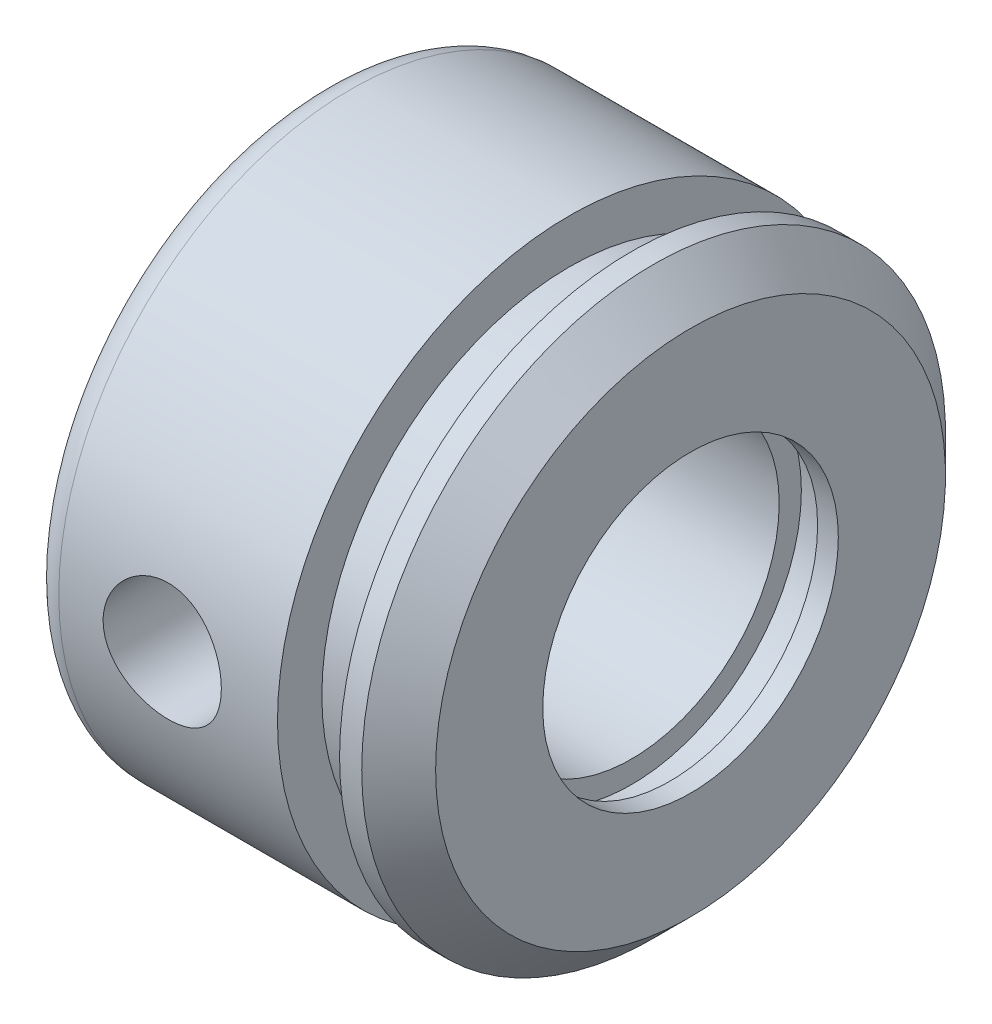
ISO-10303-21;
HEADER;
FILE_DESCRIPTION(('STEP AP214'),'2;1');
FILE_NAME('part.step','',(''),(''),'','','');
FILE_SCHEMA(('AUTOMOTIVE_DESIGN { 1 0 10303 214 1 1 1 1 }'));
ENDSEC;
DATA;
#1=APPLICATION_CONTEXT('core data for automotive mechanical design processes');
#2=APPLICATION_PROTOCOL_DEFINITION('international standard','automotive_design',2000,#1);
#3=PRODUCT_CONTEXT('',#1,'mechanical');
#4=PRODUCT('Part','Part','',(#3));
#5=PRODUCT_RELATED_PRODUCT_CATEGORY('part','',(#4));
#6=PRODUCT_DEFINITION_FORMATION('','',#4);
#7=PRODUCT_DEFINITION_CONTEXT('part definition',#1,'design');
#8=PRODUCT_DEFINITION('design','',#6,#7);
#9=PRODUCT_DEFINITION_SHAPE('','',#8);
#10=(LENGTH_UNIT() NAMED_UNIT(*) SI_UNIT(.MILLI.,.METRE.));
#11=(NAMED_UNIT(*) PLANE_ANGLE_UNIT() SI_UNIT($,.RADIAN.));
#12=(NAMED_UNIT(*) SI_UNIT($,.STERADIAN.) SOLID_ANGLE_UNIT());
#13=UNCERTAINTY_MEASURE_WITH_UNIT(LENGTH_MEASURE(1.E-05),#10,'distance_accuracy_value','');
#14=(GEOMETRIC_REPRESENTATION_CONTEXT(3) GLOBAL_UNCERTAINTY_ASSIGNED_CONTEXT((#13)) GLOBAL_UNIT_ASSIGNED_CONTEXT((#10,
#11,#12)) REPRESENTATION_CONTEXT('',''));
#15=CARTESIAN_POINT('',(0.,0.,0.));
#16=DIRECTION('',(0.,0.,1.));
#17=DIRECTION('',(1.,0.,0.));
#18=AXIS2_PLACEMENT_3D('',#15,#16,#17);
#19=CARTESIAN_POINT('',(-92.,0.,0.));
#20=DIRECTION('',(-1.,0.,0.));
#21=DIRECTION('',(0.,0.,1.));
#22=AXIS2_PLACEMENT_3D('',#19,#20,#21);
#23=CYLINDRICAL_SURFACE('',#22,19.75);
#24=CARTESIAN_POINT('',(-22.,0.,0.));
#25=DIRECTION('',(-1.,0.,0.));
#26=DIRECTION('',(0.,0.,1.));
#27=AXIS2_PLACEMENT_3D('',#24,#25,#26);
#28=CIRCLE('',#27,19.75);
#29=CARTESIAN_POINT('',(-22.,0.,19.75));
#30=VERTEX_POINT('',#29);
#31=EDGE_CURVE('E10',#30,#30,#28,.F.);
#32=ORIENTED_EDGE('',*,*,#31,.T.);
#33=EDGE_LOOP('',(#32));
#34=FACE_BOUND('',#33,.T.);
#35=CARTESIAN_POINT('',(-11.,0.,-19.75));
#36=CARTESIAN_POINT('',(-11.0000081048438,-0.22224806995432,-19.7499958962363));
#37=CARTESIAN_POINT('',(-11.018585405714,-0.444597992091762,-19.7462100877467));
#38=CARTESIAN_POINT('',(-11.092342402588,-0.8830088969307,-19.7314729765692));
#39=CARTESIAN_POINT('',(-11.147550796504,-1.09906481006599,-19.7205160559057));
#40=CARTESIAN_POINT('',(-11.2927912807559,-1.51848598286426,-19.6926597594527));
#41=CARTESIAN_POINT('',(-11.3827896191594,-1.72186332141992,-19.6757661446668));
#42=CARTESIAN_POINT('',(-11.5949540611827,-2.11061840451368,-19.6378712324076));
#43=CARTESIAN_POINT('',(-11.717118391909,-2.29599714031045,-19.6168701613415));
#44=CARTESIAN_POINT('',(-11.9919430317982,-2.6460772527497,-19.5727446180067));
#45=CARTESIAN_POINT('',(-12.1449634523736,-2.81049304028278,-19.5495970012139));
#46=CARTESIAN_POINT('',(-12.476382594132,-3.1115067612523,-19.5039549292504));
#47=CARTESIAN_POINT('',(-12.6547833303368,-3.24810248387175,-19.4814605261113));
#48=CARTESIAN_POINT('',(-13.0339607109168,-3.49082000171905,-19.439445502203));
#49=CARTESIAN_POINT('',(-13.2349309309764,-3.59664499846113,-19.4199546451824));
#50=CARTESIAN_POINT('',(-13.6522600560012,-3.77291537181802,-19.386482707602));
#51=CARTESIAN_POINT('',(-13.8686173971148,-3.84336433798359,-19.3725010680613));
#52=CARTESIAN_POINT('',(-14.3075031395602,-3.94595354018195,-19.3518649919567));
#53=CARTESIAN_POINT('',(-14.5299096749315,-3.97859545063143,-19.3451146929563));
#54=CARTESIAN_POINT('',(-14.9771370229767,-4.00620242058267,-19.3394171376453));
#55=CARTESIAN_POINT('',(-15.2019575798835,-4.00117143297835,-19.3404690626726));
#56=CARTESIAN_POINT('',(-15.6439531457213,-3.95398078024641,-19.3501700409036));
#57=CARTESIAN_POINT('',(-15.8611926363499,-3.91239720638177,-19.3587012111185));
#58=CARTESIAN_POINT('',(-16.2855466486746,-3.79419156186473,-19.3822137192734));
#59=CARTESIAN_POINT('',(-16.4926606751862,-3.71756777946928,-19.3971953723227));
#60=CARTESIAN_POINT('',(-16.8925394641773,-3.53090946742583,-19.4320407440898));
#61=CARTESIAN_POINT('',(-17.085195057076,-3.42064748971734,-19.4519375169913));
#62=CARTESIAN_POINT('',(-17.4494851344402,-3.17000312790072,-19.4943501681082));
#63=CARTESIAN_POINT('',(-17.6211171403312,-3.02961719768965,-19.5168663545304));
#64=CARTESIAN_POINT('',(-17.9418112685913,-2.71963004925279,-19.5624908847158));
#65=CARTESIAN_POINT('',(-18.0903982873366,-2.54953737608477,-19.585602487023));
#66=CARTESIAN_POINT('',(-18.3570075500807,-2.18659585342351,-19.6294334309143));
#67=CARTESIAN_POINT('',(-18.4750293827025,-1.99374669770145,-19.6501527402985));
#68=CARTESIAN_POINT('',(-18.67724976877,-1.59023196380784,-19.6869175229428));
#69=CARTESIAN_POINT('',(-18.7613929787286,-1.37953790851563,-19.7029553369428));
#70=CARTESIAN_POINT('',(-18.8929554895486,-0.946606869842553,-19.7284921446276));
#71=CARTESIAN_POINT('',(-18.9403793545307,-0.72437132470479,-19.7379919509538));
#72=CARTESIAN_POINT('',(-18.9964819581576,-0.278747524608179,-19.7492688738016));
#73=CARTESIAN_POINT('',(-19.005810725046,-0.0554442844005153,-19.7511755402605));
#74=CARTESIAN_POINT('',(-18.9872103970194,0.389530115911798,-19.7474116073557));
#75=CARTESIAN_POINT('',(-18.9592834523788,0.611201369466742,-19.7417414453012));
#76=CARTESIAN_POINT('',(-18.8675043659978,1.04451493822208,-19.7235421195795));
#77=CARTESIAN_POINT('',(-18.8039867217177,1.25623102179643,-19.7110768485899));
#78=CARTESIAN_POINT('',(-18.643195540891,1.66600722123357,-19.6806802036847));
#79=CARTESIAN_POINT('',(-18.5459194277112,1.86406629333409,-19.6627484125468));
#80=CARTESIAN_POINT('',(-18.3189731664371,2.24364076398116,-19.6230855410972));
#81=CARTESIAN_POINT('',(-18.1889128990941,2.42491813774279,-19.6013097275381));
#82=CARTESIAN_POINT('',(-17.9006114834631,2.76330822552575,-19.556477585192));
#83=CARTESIAN_POINT('',(-17.7423672312408,2.92041827441668,-19.5334211155577));
#84=CARTESIAN_POINT('',(-17.3992274444809,3.20853073961514,-19.4881881633942));
#85=CARTESIAN_POINT('',(-17.2139537767602,3.33908638020733,-19.4660310848181));
#86=CARTESIAN_POINT('',(-16.8237248478528,3.56722604575109,-19.4255213233158));
#87=CARTESIAN_POINT('',(-16.6187703847923,3.66481140704029,-19.4071684862093));
#88=CARTESIAN_POINT('',(-16.1960413197888,3.82363546727091,-19.37650286034));
#89=CARTESIAN_POINT('',(-15.9783408476562,3.88506506501422,-19.3641584088752));
#90=CARTESIAN_POINT('',(-15.5354305006131,3.970410497234,-19.3468413674368));
#91=CARTESIAN_POINT('',(-15.3102216373576,3.99433136481509,-19.3418677884083));
#92=CARTESIAN_POINT('',(-14.8631754278964,4.00379034003382,-19.3399115079409));
#93=CARTESIAN_POINT('',(-14.64135336886,3.99003472091527,-19.3427817657639));
#94=CARTESIAN_POINT('',(-14.203255590768,3.92609258628965,-19.3558606985548));
#95=CARTESIAN_POINT('',(-13.9869798246324,3.8759063801309,-19.3660693112094));
#96=CARTESIAN_POINT('',(-13.5665778523039,3.74084622389978,-19.3926081690103));
#97=CARTESIAN_POINT('',(-13.3624220887846,3.65606099786355,-19.4089227475144));
#98=CARTESIAN_POINT('',(-12.9711235641138,3.45429149146972,-19.4458438523061));
#99=CARTESIAN_POINT('',(-12.7839822776071,3.33730442371053,-19.4664507501007));
#100=CARTESIAN_POINT('',(-12.4285126472362,3.07204888065449,-19.5100831370961));
#101=CARTESIAN_POINT('',(-12.2605686016429,2.92327121184783,-19.5331444906023));
#102=CARTESIAN_POINT('',(-11.9517965790597,2.59970653572918,-19.5788321505124));
#103=CARTESIAN_POINT('',(-11.8109748448775,2.4249135567845,-19.6014583556808));
#104=CARTESIAN_POINT('',(-11.5590083718832,2.05201434266876,-19.6440142476618));
#105=CARTESIAN_POINT('',(-11.4481999643862,1.85367707395027,-19.663912231917));
#106=CARTESIAN_POINT('',(-11.2616620974872,1.44084701523437,-19.6984569973284));
#107=CARTESIAN_POINT('',(-11.1859013032398,1.22636885653041,-19.7131084665515));
#108=CARTESIAN_POINT('',(-11.0861307153843,0.842868488706423,-19.7326930123798));
#109=CARTESIAN_POINT('',(-11.0538897988215,0.676016148606986,-19.7391448663407));
#110=CARTESIAN_POINT('',(-11.0108217027504,0.339462283889183,-19.7477998566169));
#111=CARTESIAN_POINT('',(-10.9999938092366,0.169760854462413,-19.7500031345984));
#112=CARTESIAN_POINT('',(-11.,0.,-19.75));
#113=B_SPLINE_CURVE_WITH_KNOTS('',3,(#35,#36,#37,#38,#39,#40,#41,#42,#43,#44,#45,#46,#47,#48,
#49,#50,#51,#52,#53,#54,#55,#56,#57,#58,#59,#60,#61,#62,#63,#64,#65,#66,#67,#68,#69,#70,#71,#72,
#73,#74,#75,#76,#77,#78,#79,#80,#81,#82,#83,#84,#85,#86,#87,#88,#89,#90,#91,#92,#93,#94,#95,#96,
#97,#98,#99,#100,#101,#102,#103,#104,#105,#106,#107,#108,#109,#110,#111,#112),.UNSPECIFIED.,.T.,
.F.,(4,2,2,2,2,2,2,2,2,2,2,2,2,2,2,2,2,2,2,2,2,2,2,2,2,2,2,2,2,2,2,2,2,2,2,2,2,2,4),(0.,
0.666123128202852,1.33276873467623,1.99876920258741,2.66473297022347,3.33897276094297,
4.01326611155423,4.69386258860974,5.37438999263846,6.04577988155233,6.71709932470904,
7.37802433453845,8.0389816345483,8.70451102092719,9.37011879448611,10.0480131409169,
10.7259166106586,11.4049230410955,12.0838450592151,12.7511327510065,13.4183819308623,
14.0794627198652,14.7405939773139,15.4099980521368,16.0794758948312,16.7594248396206,
17.4393462216956,18.1156447130886,18.7918524476783,19.4554713635581,20.1190846444206,
20.7810067757975,21.4429862213909,22.1164917980326,22.790152212289,23.4710756873757,
24.151389190379,24.6602143166334,25.1690224761109),.UNSPECIFIED.);
#114=CARTESIAN_POINT('',(-11.,0.,-19.75));
#115=VERTEX_POINT('',#114);
#116=EDGE_CURVE('E62',#115,#115,#113,.T.);
#117=ORIENTED_EDGE('',*,*,#116,.F.);
#118=EDGE_LOOP('',(#117));
#119=FACE_BOUND('',#118,.T.);
#120=CARTESIAN_POINT('',(-11.,0.,19.75));
#121=CARTESIAN_POINT('',(-11.0000081048438,0.222248069954321,19.7499958962363));
#122=CARTESIAN_POINT('',(-11.018585405714,0.444597992091763,19.7462100877467));
#123=CARTESIAN_POINT('',(-11.092342402588,0.8830088969307,19.7314729765692));
#124=CARTESIAN_POINT('',(-11.147550796504,1.09906481006599,19.7205160559057));
#125=CARTESIAN_POINT('',(-11.2927912807559,1.51848598286426,19.6926597594527));
#126=CARTESIAN_POINT('',(-11.3827896191594,1.72186332141992,19.6757661446668));
#127=CARTESIAN_POINT('',(-11.5949540611827,2.11061840451368,19.6378712324076));
#128=CARTESIAN_POINT('',(-11.717118391909,2.29599714031044,19.6168701613415));
#129=CARTESIAN_POINT('',(-11.9919430317982,2.6460772527497,19.5727446180067));
#130=CARTESIAN_POINT('',(-12.1449634523736,2.81049304028278,19.5495970012139));
#131=CARTESIAN_POINT('',(-12.476382594132,3.1115067612523,19.5039549292504));
#132=CARTESIAN_POINT('',(-12.6547833303368,3.24810248387175,19.4814605261113));
#133=CARTESIAN_POINT('',(-13.0339607109168,3.49082000171905,19.439445502203));
#134=CARTESIAN_POINT('',(-13.2349309309764,3.59664499846114,19.4199546451824));
#135=CARTESIAN_POINT('',(-13.6522600560012,3.77291537181803,19.386482707602));
#136=CARTESIAN_POINT('',(-13.8686173971148,3.84336433798359,19.3725010680613));
#137=CARTESIAN_POINT('',(-14.3075031395602,3.94595354018195,19.3518649919567));
#138=CARTESIAN_POINT('',(-14.5299096749315,3.97859545063143,19.3451146929563));
#139=CARTESIAN_POINT('',(-14.9771370229767,4.00620242058267,19.3394171376453));
#140=CARTESIAN_POINT('',(-15.2019575798835,4.00117143297835,19.3404690626726));
#141=CARTESIAN_POINT('',(-15.6439531457213,3.95398078024641,19.3501700409036));
#142=CARTESIAN_POINT('',(-15.8611926363499,3.91239720638177,19.3587012111185));
#143=CARTESIAN_POINT('',(-16.2855466486746,3.79419156186472,19.3822137192734));
#144=CARTESIAN_POINT('',(-16.4926606751862,3.71756777946928,19.3971953723227));
#145=CARTESIAN_POINT('',(-16.8925394641773,3.53090946742583,19.4320407440898));
#146=CARTESIAN_POINT('',(-17.085195057076,3.42064748971733,19.4519375169913));
#147=CARTESIAN_POINT('',(-17.4494851344402,3.17000312790072,19.4943501681082));
#148=CARTESIAN_POINT('',(-17.6211171403312,3.02961719768965,19.5168663545304));
#149=CARTESIAN_POINT('',(-17.9418112685913,2.71963004925278,19.5624908847158));
#150=CARTESIAN_POINT('',(-18.0903982873366,2.54953737608477,19.585602487023));
#151=CARTESIAN_POINT('',(-18.3570075500807,2.18659585342351,19.6294334309143));
#152=CARTESIAN_POINT('',(-18.4750293827025,1.99374669770145,19.6501527402985));
#153=CARTESIAN_POINT('',(-18.67724976877,1.59023196380784,19.6869175229428));
#154=CARTESIAN_POINT('',(-18.7613929787286,1.37953790851563,19.7029553369428));
#155=CARTESIAN_POINT('',(-18.8929554895486,0.946606869842551,19.7284921446276));
#156=CARTESIAN_POINT('',(-18.9403793545307,0.724371324704788,19.7379919509538));
#157=CARTESIAN_POINT('',(-18.9964819581576,0.278747524608176,19.7492688738016));
#158=CARTESIAN_POINT('',(-19.005810725046,0.0554442844005117,19.7511755402605));
#159=CARTESIAN_POINT('',(-18.9872103970194,-0.389530115911801,19.7474116073557));
#160=CARTESIAN_POINT('',(-18.9592834523788,-0.611201369466745,19.7417414453012));
#161=CARTESIAN_POINT('',(-18.8675043659978,-1.04451493822208,19.7235421195795));
#162=CARTESIAN_POINT('',(-18.8039867217177,-1.25623102179644,19.7110768485899));
#163=CARTESIAN_POINT('',(-18.643195540891,-1.66600722123358,19.6806802036847));
#164=CARTESIAN_POINT('',(-18.5459194277112,-1.8640662933341,19.6627484125468));
#165=CARTESIAN_POINT('',(-18.3189731664371,-2.24364076398116,19.6230855410972));
#166=CARTESIAN_POINT('',(-18.1889128990941,-2.4249181377428,19.6013097275381));
#167=CARTESIAN_POINT('',(-17.9006114834631,-2.76330822552576,19.556477585192));
#168=CARTESIAN_POINT('',(-17.7423672312408,-2.92041827441668,19.5334211155577));
#169=CARTESIAN_POINT('',(-17.3992274444809,-3.20853073961514,19.4881881633942));
#170=CARTESIAN_POINT('',(-17.2139537767602,-3.33908638020733,19.4660310848181));
#171=CARTESIAN_POINT('',(-16.8237248478528,-3.56722604575109,19.4255213233158));
#172=CARTESIAN_POINT('',(-16.6187703847923,-3.66481140704029,19.4071684862093));
#173=CARTESIAN_POINT('',(-16.1960413197888,-3.82363546727091,19.37650286034));
#174=CARTESIAN_POINT('',(-15.9783408476562,-3.88506506501422,19.3641584088752));
#175=CARTESIAN_POINT('',(-15.5354305006131,-3.970410497234,19.3468413674368));
#176=CARTESIAN_POINT('',(-15.3102216373576,-3.99433136481509,19.3418677884083));
#177=CARTESIAN_POINT('',(-14.8631754278964,-4.00379034003382,19.3399115079409));
#178=CARTESIAN_POINT('',(-14.64135336886,-3.99003472091527,19.3427817657639));
#179=CARTESIAN_POINT('',(-14.203255590768,-3.92609258628965,19.3558606985548));
#180=CARTESIAN_POINT('',(-13.9869798246324,-3.8759063801309,19.3660693112094));
#181=CARTESIAN_POINT('',(-13.5665778523039,-3.74084622389978,19.3926081690103));
#182=CARTESIAN_POINT('',(-13.3624220887846,-3.65606099786355,19.4089227475144));
#183=CARTESIAN_POINT('',(-12.9711235641138,-3.45429149146972,19.4458438523061));
#184=CARTESIAN_POINT('',(-12.7839822776071,-3.33730442371053,19.4664507501007));
#185=CARTESIAN_POINT('',(-12.4285126472362,-3.07204888065449,19.5100831370961));
#186=CARTESIAN_POINT('',(-12.2605686016429,-2.92327121184783,19.5331444906023));
#187=CARTESIAN_POINT('',(-11.9517965790597,-2.59970653572918,19.5788321505124));
#188=CARTESIAN_POINT('',(-11.8109748448775,-2.4249135567845,19.6014583556808));
#189=CARTESIAN_POINT('',(-11.5590083718832,-2.05201434266876,19.6440142476618));
#190=CARTESIAN_POINT('',(-11.4481999643862,-1.85367707395027,19.663912231917));
#191=CARTESIAN_POINT('',(-11.2616620974872,-1.44084701523437,19.6984569973284));
#192=CARTESIAN_POINT('',(-11.1859013032398,-1.22636885653041,19.7131084665515));
#193=CARTESIAN_POINT('',(-11.0861307153843,-0.842868488706419,19.7326930123798));
#194=CARTESIAN_POINT('',(-11.0538897988215,-0.676016148606982,19.7391448663407));
#195=CARTESIAN_POINT('',(-11.0108217027504,-0.339462283889181,19.7477998566169));
#196=CARTESIAN_POINT('',(-10.9999938092366,-0.169760854462413,19.7500031345984));
#197=CARTESIAN_POINT('',(-11.,0.,19.75));
#198=B_SPLINE_CURVE_WITH_KNOTS('',3,(#120,#121,#122,#123,#124,#125,#126,#127,#128,#129,#130,
#131,#132,#133,#134,#135,#136,#137,#138,#139,#140,#141,#142,#143,#144,#145,#146,#147,#148,#149,
#150,#151,#152,#153,#154,#155,#156,#157,#158,#159,#160,#161,#162,#163,#164,#165,#166,#167,#168,
#169,#170,#171,#172,#173,#174,#175,#176,#177,#178,#179,#180,#181,#182,#183,#184,#185,#186,#187,
#188,#189,#190,#191,#192,#193,#194,#195,#196,#197),.UNSPECIFIED.,.T.,.F.,(4,2,2,2,2,2,2,2,2,2,2,
2,2,2,2,2,2,2,2,2,2,2,2,2,2,2,2,2,2,2,2,2,2,2,2,2,2,2,4),(0.,0.666123128202852,1.33276873467623,
1.99876920258741,2.66473297022347,3.33897276094297,4.01326611155423,4.69386258860974,
5.37438999263846,6.04577988155233,6.71709932470904,7.37802433453846,8.0389816345483,
8.70451102092719,9.37011879448611,10.0480131409169,10.7259166106586,11.4049230410955,
12.0838450592151,12.7511327510065,13.4183819308623,14.0794627198652,14.7405939773139,
15.4099980521368,16.0794758948312,16.7594248396206,17.4393462216957,18.1156447130887,
18.7918524476783,19.4554713635581,20.1190846444206,20.7810067757975,21.4429862213909,
22.1164917980326,22.790152212289,23.4710756873757,24.151389190379,24.6602143166334,
25.169022476111),.UNSPECIFIED.);
#199=CARTESIAN_POINT('',(-11.,0.,19.75));
#200=VERTEX_POINT('',#199);
#201=EDGE_CURVE('E86',#200,#200,#198,.T.);
#202=ORIENTED_EDGE('',*,*,#201,.F.);
#203=EDGE_LOOP('',(#202));
#204=FACE_BOUND('',#203,.T.);
#205=CARTESIAN_POINT('',(-7.2,0.,0.));
#206=DIRECTION('',(-1.,0.,0.));
#207=DIRECTION('',(0.,0.,1.));
#208=AXIS2_PLACEMENT_3D('',#205,#206,#207);
#209=CIRCLE('',#208,19.75);
#210=CARTESIAN_POINT('',(-7.2,0.,19.75));
#211=VERTEX_POINT('',#210);
#212=EDGE_CURVE('E45',#211,#211,#209,.T.);
#213=ORIENTED_EDGE('',*,*,#212,.T.);
#214=EDGE_LOOP('',(#213));
#215=FACE_BOUND('',#214,.T.);
#216=ADVANCED_FACE('F33',(#34,#119,#204,#215),#23,.T.);
#217=CARTESIAN_POINT('',(-7.2,19.75,0.));
#218=DIRECTION('',(1.,0.,0.));
#219=DIRECTION('',(0.,0.,-1.));
#220=AXIS2_PLACEMENT_3D('',#217,#218,#219);
#221=PLANE('',#220);
#222=CARTESIAN_POINT('',(-7.2,0.,0.));
#223=DIRECTION('',(-1.,0.,0.));
#224=DIRECTION('',(0.,0.,1.));
#225=AXIS2_PLACEMENT_3D('',#222,#223,#224);
#226=CIRCLE('',#225,16.75);
#227=CARTESIAN_POINT('',(-7.2,0.,16.75));
#228=VERTEX_POINT('',#227);
#229=EDGE_CURVE('E52',#228,#228,#226,.T.);
#230=ORIENTED_EDGE('',*,*,#229,.T.);
#231=EDGE_LOOP('',(#230));
#232=FACE_BOUND('',#231,.T.);
#233=ORIENTED_EDGE('',*,*,#212,.F.);
#234=EDGE_LOOP('',(#233));
#235=FACE_BOUND('',#234,.T.);
#236=ADVANCED_FACE('F124',(#232,#235),#221,.T.);
#237=CARTESIAN_POINT('',(-92.,0.,0.));
#238=DIRECTION('',(-1.,0.,0.));
#239=DIRECTION('',(0.,0.,1.));
#240=AXIS2_PLACEMENT_3D('',#237,#238,#239);
#241=CYLINDRICAL_SURFACE('',#240,16.75);
#242=CARTESIAN_POINT('',(-3.,0.,0.));
#243=DIRECTION('',(-1.,0.,0.));
#244=DIRECTION('',(0.,0.,1.));
#245=AXIS2_PLACEMENT_3D('',#242,#243,#244);
#246=CIRCLE('',#245,16.75);
#247=CARTESIAN_POINT('',(-3.,0.,16.75));
#248=VERTEX_POINT('',#247);
#249=EDGE_CURVE('E118',#248,#248,#246,.T.);
#250=ORIENTED_EDGE('',*,*,#249,.T.);
#251=EDGE_LOOP('',(#250));
#252=FACE_BOUND('',#251,.T.);
#253=ORIENTED_EDGE('',*,*,#229,.F.);
#254=EDGE_LOOP('',(#253));
#255=FACE_BOUND('',#254,.T.);
#256=ADVANCED_FACE('F127',(#252,#255),#241,.T.);
#257=CARTESIAN_POINT('',(-3.,16.75,0.));
#258=DIRECTION('',(-1.,0.,0.));
#259=DIRECTION('',(0.,0.,1.));
#260=AXIS2_PLACEMENT_3D('',#257,#258,#259);
#261=PLANE('',#260);
#262=CARTESIAN_POINT('',(-3.,0.,0.));
#263=DIRECTION('',(-1.,0.,0.));
#264=DIRECTION('',(0.,0.,1.));
#265=AXIS2_PLACEMENT_3D('',#262,#263,#264);
#266=CIRCLE('',#265,19.75);
#267=CARTESIAN_POINT('',(-3.,0.,19.75));
#268=VERTEX_POINT('',#267);
#269=EDGE_CURVE('E115',#268,#268,#266,.T.);
#270=ORIENTED_EDGE('',*,*,#269,.T.);
#271=EDGE_LOOP('',(#270));
#272=FACE_BOUND('',#271,.T.);
#273=ORIENTED_EDGE('',*,*,#249,.F.);
#274=EDGE_LOOP('',(#273));
#275=FACE_BOUND('',#274,.T.);
#276=ADVANCED_FACE('F129',(#272,#275),#261,.T.);
#277=CARTESIAN_POINT('',(-92.,0.,0.));
#278=DIRECTION('',(-1.,0.,0.));
#279=DIRECTION('',(0.,0.,1.));
#280=AXIS2_PLACEMENT_3D('',#277,#278,#279);
#281=CYLINDRICAL_SURFACE('',#280,19.75);
#282=CARTESIAN_POINT('',(-1.5,0.,0.));
#283=DIRECTION('',(-1.,0.,0.));
#284=DIRECTION('',(0.,0.,1.));
#285=AXIS2_PLACEMENT_3D('',#282,#283,#284);
#286=CIRCLE('',#285,19.75);
#287=CARTESIAN_POINT('',(-1.5,0.,19.75));
#288=VERTEX_POINT('',#287);
#289=EDGE_CURVE('E112',#288,#288,#286,.T.);
#290=ORIENTED_EDGE('',*,*,#289,.T.);
#291=EDGE_LOOP('',(#290));
#292=FACE_BOUND('',#291,.T.);
#293=ORIENTED_EDGE('',*,*,#269,.F.);
#294=EDGE_LOOP('',(#293));
#295=FACE_BOUND('',#294,.T.);
#296=ADVANCED_FACE('F136',(#292,#295),#281,.T.);
#297=CARTESIAN_POINT('',(-1.5,0.,0.));
#298=DIRECTION('',(-1.,0.,0.));
#299=DIRECTION('',(0.,0.,1.));
#300=AXIS2_PLACEMENT_3D('',#297,#298,#299);
#301=CONICAL_SURFACE('',#300,19.75,0.785398163397442);
#302=CARTESIAN_POINT('',(1.,0.,0.));
#303=DIRECTION('',(-1.,0.,0.));
#304=DIRECTION('',(0.,0.,1.));
#305=AXIS2_PLACEMENT_3D('',#302,#303,#304);
#306=CIRCLE('',#305,17.25);
#307=CARTESIAN_POINT('',(1.,0.,17.25));
#308=VERTEX_POINT('',#307);
#309=EDGE_CURVE('E109',#308,#308,#306,.T.);
#310=ORIENTED_EDGE('',*,*,#309,.T.);
#311=EDGE_LOOP('',(#310));
#312=FACE_BOUND('',#311,.T.);
#313=ORIENTED_EDGE('',*,*,#289,.F.);
#314=EDGE_LOOP('',(#313));
#315=FACE_BOUND('',#314,.T.);
#316=ADVANCED_FACE('F188',(#312,#315),#301,.T.);
#317=CARTESIAN_POINT('',(0.999999999999997,17.25,0.));
#318=DIRECTION('',(1.,0.,0.));
#319=DIRECTION('',(0.,0.,-1.));
#320=AXIS2_PLACEMENT_3D('',#317,#318,#319);
#321=PLANE('',#320);
#322=CARTESIAN_POINT('',(1.,0.,0.));
#323=DIRECTION('',(-1.,0.,0.));
#324=DIRECTION('',(0.,0.,1.));
#325=AXIS2_PLACEMENT_3D('',#322,#323,#324);
#326=CIRCLE('',#325,10.);
#327=CARTESIAN_POINT('',(1.,0.,10.));
#328=VERTEX_POINT('',#327);
#329=EDGE_CURVE('E106',#328,#328,#326,.T.);
#330=ORIENTED_EDGE('',*,*,#329,.T.);
#331=EDGE_LOOP('',(#330));
#332=FACE_BOUND('',#331,.T.);
#333=ORIENTED_EDGE('',*,*,#309,.F.);
#334=EDGE_LOOP('',(#333));
#335=FACE_BOUND('',#334,.T.);
#336=ADVANCED_FACE('F182',(#332,#335),#321,.T.);
#337=CARTESIAN_POINT('',(-92.,0.,0.));
#338=DIRECTION('',(-1.,0.,0.));
#339=DIRECTION('',(0.,0.,1.));
#340=AXIS2_PLACEMENT_3D('',#337,#338,#339);
#341=CYLINDRICAL_SURFACE('',#340,10.);
#342=CARTESIAN_POINT('',(-0.400000000000011,0.,0.));
#343=DIRECTION('',(-1.,0.,0.));
#344=DIRECTION('',(0.,0.,1.));
#345=AXIS2_PLACEMENT_3D('',#342,#343,#344);
#346=CIRCLE('',#345,10.);
#347=CARTESIAN_POINT('',(-0.400000000000011,0.,10.));
#348=VERTEX_POINT('',#347);
#349=EDGE_CURVE('E103',#348,#348,#346,.T.);
#350=ORIENTED_EDGE('',*,*,#349,.T.);
#351=EDGE_LOOP('',(#350));
#352=FACE_BOUND('',#351,.T.);
#353=ORIENTED_EDGE('',*,*,#329,.F.);
#354=EDGE_LOOP('',(#353));
#355=FACE_BOUND('',#354,.T.);
#356=ADVANCED_FACE('F176',(#352,#355),#341,.F.);
#357=CARTESIAN_POINT('',(-0.400000000000005,10.,0.));
#358=DIRECTION('',(-1.,0.,0.));
#359=DIRECTION('',(0.,0.,1.));
#360=AXIS2_PLACEMENT_3D('',#357,#358,#359);
#361=PLANE('',#360);
#362=CARTESIAN_POINT('',(-0.400000000000011,0.,0.));
#363=DIRECTION('',(-1.,0.,0.));
#364=DIRECTION('',(0.,0.,1.));
#365=AXIS2_PLACEMENT_3D('',#362,#363,#364);
#366=CIRCLE('',#365,11.5);
#367=CARTESIAN_POINT('',(-0.400000000000011,0.,11.5));
#368=VERTEX_POINT('',#367);
#369=EDGE_CURVE('E100',#368,#368,#366,.T.);
#370=ORIENTED_EDGE('',*,*,#369,.T.);
#371=EDGE_LOOP('',(#370));
#372=FACE_BOUND('',#371,.T.);
#373=ORIENTED_EDGE('',*,*,#349,.F.);
#374=EDGE_LOOP('',(#373));
#375=FACE_BOUND('',#374,.T.);
#376=ADVANCED_FACE('F170',(#372,#375),#361,.T.);
#377=CARTESIAN_POINT('',(-92.,0.,0.));
#378=DIRECTION('',(-1.,0.,0.));
#379=DIRECTION('',(0.,0.,1.));
#380=AXIS2_PLACEMENT_3D('',#377,#378,#379);
#381=CYLINDRICAL_SURFACE('',#380,11.5);
#382=CARTESIAN_POINT('',(-3.,0.,0.));
#383=DIRECTION('',(-1.,0.,0.));
#384=DIRECTION('',(0.,0.,1.));
#385=AXIS2_PLACEMENT_3D('',#382,#383,#384);
#386=CIRCLE('',#385,11.5);
#387=CARTESIAN_POINT('',(-3.,0.,11.5));
#388=VERTEX_POINT('',#387);
#389=EDGE_CURVE('E97',#388,#388,#386,.T.);
#390=ORIENTED_EDGE('',*,*,#389,.T.);
#391=EDGE_LOOP('',(#390));
#392=FACE_BOUND('',#391,.T.);
#393=ORIENTED_EDGE('',*,*,#369,.F.);
#394=EDGE_LOOP('',(#393));
#395=FACE_BOUND('',#394,.T.);
#396=ADVANCED_FACE('F165',(#392,#395),#381,.F.);
#397=CARTESIAN_POINT('',(-3.,11.5,0.));
#398=DIRECTION('',(1.,0.,0.));
#399=DIRECTION('',(0.,0.,-1.));
#400=AXIS2_PLACEMENT_3D('',#397,#398,#399);
#401=PLANE('',#400);
#402=CARTESIAN_POINT('',(-3.,0.,0.));
#403=DIRECTION('',(-1.,0.,0.));
#404=DIRECTION('',(0.,0.,1.));
#405=AXIS2_PLACEMENT_3D('',#402,#403,#404);
#406=CIRCLE('',#405,10.);
#407=CARTESIAN_POINT('',(-3.,0.,10.));
#408=VERTEX_POINT('',#407);
#409=EDGE_CURVE('E94',#408,#408,#406,.T.);
#410=ORIENTED_EDGE('',*,*,#409,.T.);
#411=EDGE_LOOP('',(#410));
#412=FACE_BOUND('',#411,.T.);
#413=ORIENTED_EDGE('',*,*,#389,.F.);
#414=EDGE_LOOP('',(#413));
#415=FACE_BOUND('',#414,.T.);
#416=ADVANCED_FACE('F155',(#412,#415),#401,.T.);
#417=CARTESIAN_POINT('',(-92.,0.,0.));
#418=DIRECTION('',(-1.,0.,0.));
#419=DIRECTION('',(0.,0.,1.));
#420=AXIS2_PLACEMENT_3D('',#417,#418,#419);
#421=CYLINDRICAL_SURFACE('',#420,10.);
#422=CARTESIAN_POINT('',(-11.,0.,10.));
#423=CARTESIAN_POINT('',(-11.0000015749329,-0.107549581345537,9.99999886871264));
#424=CARTESIAN_POINT('',(-11.0043436710802,-0.215132147940362,9.99825999367799));
#425=CARTESIAN_POINT('',(-11.0216733827839,-0.42953520054955,9.99134740691108));
#426=CARTESIAN_POINT('',(-11.0346664534026,-0.536355162703303,9.98617152790588));
#427=CARTESIAN_POINT('',(-11.0692080345506,-0.748635856497417,9.97250573560117));
#428=CARTESIAN_POINT('',(-11.0907750546198,-0.85409313444087,9.96400865312144));
#429=CARTESIAN_POINT('',(-11.1422417304368,-1.0626676111401,9.94393017211574));
#430=CARTESIAN_POINT('',(-11.1721447662553,-1.16578384227259,9.932347522545));
#431=CARTESIAN_POINT('',(-11.273722808716,-1.46979509681069,9.89349112162205));
#432=CARTESIAN_POINT('',(-11.3574218190064,-1.66629107461992,9.86204458846134));
#433=CARTESIAN_POINT('',(-11.5540462173498,-2.04217417878101,9.79113035538708));
#434=CARTESIAN_POINT('',(-11.6669614601149,-2.22156721456798,9.75166544086262));
#435=CARTESIAN_POINT('',(-11.9244687545217,-2.56699339938209,9.66661825353092));
#436=CARTESIAN_POINT('',(-12.0702127105756,-2.73212223266508,9.62084608086599));
#437=CARTESIAN_POINT('',(-12.386800609152,-3.03635232313263,9.52921139577231));
#438=CARTESIAN_POINT('',(-12.5576567590165,-3.17544084661153,9.48334885017047));
#439=CARTESIAN_POINT('',(-12.9288559685663,-3.42974847409894,9.39445587657958));
#440=CARTESIAN_POINT('',(-13.1301729260637,-3.54362978572887,9.35164233015934));
#441=CARTESIAN_POINT('',(-13.5510728428009,-3.73550961465233,9.2766729328807));
#442=CARTESIAN_POINT('',(-13.7706470677414,-3.81352517485723,9.24451202207146));
#443=CARTESIAN_POINT('',(-14.2114246556858,-3.92779760260541,9.19652715590089));
#444=CARTESIAN_POINT('',(-14.4321024680881,-3.96578791979826,9.18002840771385));
#445=CARTESIAN_POINT('',(-14.8772699996773,-4.00434593508728,9.16328008038143));
#446=CARTESIAN_POINT('',(-15.1017577900111,-4.00493203570086,9.16302251073203));
#447=CARTESIAN_POINT('',(-15.5315133422232,-3.9699787321474,9.17821000534301));
#448=CARTESIAN_POINT('',(-15.7370314287657,-3.93695062778272,9.19256349925666));
#449=CARTESIAN_POINT('',(-16.1393191123503,-3.83989376129508,9.23352375055553));
#450=CARTESIAN_POINT('',(-16.3360871763063,-3.77585958980135,9.26013264599921));
#451=CARTESIAN_POINT('',(-16.7200356722919,-3.6173894649114,9.32318970221162));
#452=CARTESIAN_POINT('',(-16.9069384780825,-3.52235972457939,9.35982758573424));
#453=CARTESIAN_POINT('',(-17.26283163275,-3.30501292151569,9.43876232767927));
#454=CARTESIAN_POINT('',(-17.4318152188131,-3.1826856102159,9.48106130910412));
#455=CARTESIAN_POINT('',(-17.760819457596,-2.90310119889356,9.57053473488081));
#456=CARTESIAN_POINT('',(-17.9191374588899,-2.74387492593717,9.61783329953252));
#457=CARTESIAN_POINT('',(-18.2073689560062,-2.40062885486449,9.70919649915615));
#458=CARTESIAN_POINT('',(-18.3372767948212,-2.21660413066997,9.75326048890393));
#459=CARTESIAN_POINT('',(-18.5672348948311,-1.82415530521055,9.83429362529358));
#460=CARTESIAN_POINT('',(-18.666644562394,-1.61532098269266,9.87110540190899));
#461=CARTESIAN_POINT('',(-18.8283357221563,-1.18204753096606,9.93229656657448));
#462=CARTESIAN_POINT('',(-18.8906360751149,-0.957616393699399,9.95668226924746));
#463=CARTESIAN_POINT('',(-18.9728965908394,-0.513791775215591,9.98912279013839));
#464=CARTESIAN_POINT('',(-18.9951449085071,-0.294886587971141,9.99805891667034));
#465=CARTESIAN_POINT('',(-19.0034262010573,0.143690619615706,10.0013695702126));
#466=CARTESIAN_POINT('',(-18.9894685630952,0.363362426448183,9.99574787164577));
#467=CARTESIAN_POINT('',(-18.9274164948959,0.786865478243655,9.97115134127512));
#468=CARTESIAN_POINT('',(-18.8808840392975,0.990964983549762,9.95278782691064));
#469=CARTESIAN_POINT('',(-18.757128583381,1.38827085612275,9.90518882810983));
#470=CARTESIAN_POINT('',(-18.6799016406648,1.58147582045412,9.87595194712999));
#471=CARTESIAN_POINT('',(-18.4944301206379,1.95815757162884,9.80833189541687));
#472=CARTESIAN_POINT('',(-18.3853090559053,2.14115604549353,9.76969631959847));
#473=CARTESIAN_POINT('',(-18.1401193521971,2.4868871825104,9.68746729490809));
#474=CARTESIAN_POINT('',(-18.0040399141861,2.64961168158684,9.64387186219643));
#475=CARTESIAN_POINT('',(-17.6982599740674,2.96144608598878,9.55290235277181));
#476=CARTESIAN_POINT('',(-17.5269329168592,3.10894786734725,9.50546882853787));
#477=CARTESIAN_POINT('',(-17.1611198341097,3.37350239509234,9.4148334583058));
#478=CARTESIAN_POINT('',(-16.9666299998006,3.4905501236659,9.37163231039242));
#479=CARTESIAN_POINT('',(-16.5570766103267,3.69161500286277,9.2942859982933));
#480=CARTESIAN_POINT('',(-16.3418319997565,3.77530118531766,9.2602326182174));
#481=CARTESIAN_POINT('',(-15.8985326983872,3.90459244315908,9.20647346903737));
#482=CARTESIAN_POINT('',(-15.6704875951582,3.95022562452797,9.18675711197461));
#483=CARTESIAN_POINT('',(-15.225744190156,3.99943122157416,9.16543518780389));
#484=CARTESIAN_POINT('',(-15.009410298105,4.00579411777209,9.16262842667612));
#485=CARTESIAN_POINT('',(-14.5789103072789,3.98360636538274,9.17229671415009));
#486=CARTESIAN_POINT('',(-14.3647439367175,3.9550601501471,9.18476982225497));
#487=CARTESIAN_POINT('',(-13.9533355391097,3.86614256488129,9.2225330048627));
#488=CARTESIAN_POINT('',(-13.7557591537789,3.80707437387706,9.2472967218297));
#489=CARTESIAN_POINT('',(-13.3732430382103,3.66001151041638,9.30647993934966));
#490=CARTESIAN_POINT('',(-13.1883068148887,3.5720088493455,9.34090210615105));
#491=CARTESIAN_POINT('',(-12.8247795892905,3.36374310804133,9.41797252826471));
#492=CARTESIAN_POINT('',(-12.6471581693117,3.24192140926543,9.46097893410836));
#493=CARTESIAN_POINT('',(-12.3140178573752,2.97179350239176,9.54927479921251));
#494=CARTESIAN_POINT('',(-12.15850565271,2.82347931168581,9.59456494363941));
#495=CARTESIAN_POINT('',(-11.8635764074694,2.49297412446699,9.68587647140964));
#496=CARTESIAN_POINT('',(-11.7258566160177,2.30921017071955,9.73175488236393));
#497=CARTESIAN_POINT('',(-11.5439518910625,2.01716584575533,9.7949502762577));
#498=CARTESIAN_POINT('',(-11.487392936147,1.91699501972425,9.81509269692655));
#499=CARTESIAN_POINT('',(-11.3829620045947,1.7118011098248,9.85294835133019));
#500=CARTESIAN_POINT('',(-11.335086050192,1.60678027559742,9.87066269647665));
#501=CARTESIAN_POINT('',(-11.249252015315,1.39454646904328,9.9028559935491));
#502=CARTESIAN_POINT('',(-11.2111298452528,1.28740777135871,9.91738778532477));
#503=CARTESIAN_POINT('',(-11.1440786522788,1.06995577523383,9.94319722915714));
#504=CARTESIAN_POINT('',(-11.1151453426501,0.959643983352613,9.95447639837582));
#505=CARTESIAN_POINT('',(-11.066825163851,0.736945215856832,9.97343330649399));
#506=CARTESIAN_POINT('',(-11.047414088355,0.624564263591278,9.98112017494336));
#507=CARTESIAN_POINT('',(-11.0182614293338,0.398419132407602,9.99270031578293));
#508=CARTESIAN_POINT('',(-11.0085129731657,0.284655994966352,9.99659628445551));
#509=CARTESIAN_POINT('',(-11.0012141044266,0.113830463425492,9.99951445883957));
#510=CARTESIAN_POINT('',(-10.999999166478,0.0569198512645297,10.0000005987258));
#511=CARTESIAN_POINT('',(-11.,0.,10.));
#512=B_SPLINE_CURVE_WITH_KNOTS('',3,(#422,#423,#424,#425,#426,#427,#428,#429,#430,#431,#432,
#433,#434,#435,#436,#437,#438,#439,#440,#441,#442,#443,#444,#445,#446,#447,#448,#449,#450,#451,
#452,#453,#454,#455,#456,#457,#458,#459,#460,#461,#462,#463,#464,#465,#466,#467,#468,#469,#470,
#471,#472,#473,#474,#475,#476,#477,#478,#479,#480,#481,#482,#483,#484,#485,#486,#487,#488,#489,
#490,#491,#492,#493,#494,#495,#496,#497,#498,#499,#500,#501,#502,#503,#504,#505,#506,#507,#508,
#509,#510,#511),.UNSPECIFIED.,.T.,.F.,(4,2,2,2,2,2,2,2,2,2,2,2,2,2,2,2,2,2,2,2,2,2,2,2,2,2,2,2,
2,2,2,2,2,2,2,2,2,2,2,2,2,2,2,2,4),(0.,0.322603993422156,0.645411604786483,0.968919914471236,
1.29255959093094,1.93701523385824,2.58124739027476,3.25313995292302,3.9253602176033,
4.62749749529941,5.32930078128043,5.99927442509164,6.66891844572483,7.29195888698822,
7.9151080641227,8.55097484497806,9.18708075776541,9.87235930273289,10.5577741757964,
11.2567305822579,11.9553314412776,12.6125760095619,13.2696501904034,13.8972014302891,
14.5248332988777,15.171662586967,15.8187515089811,16.50856181149,17.1984856998767,
17.8950932218183,18.5911857719204,19.2371857868567,19.8831037702627,20.5034786899771,
21.124025035105,21.7801016801356,22.4363763459696,23.1352007896785,23.4851924266232,
23.8350233218042,24.1785111324565,24.52183846562,24.8642884495951,25.2064946871486,
25.3772305569976),.UNSPECIFIED.);
#513=CARTESIAN_POINT('',(-11.,0.,10.));
#514=VERTEX_POINT('',#513);
#515=EDGE_CURVE('E55',#514,#514,#512,.T.);
#516=ORIENTED_EDGE('',*,*,#515,.F.);
#517=EDGE_LOOP('',(#516));
#518=FACE_BOUND('',#517,.T.);
#519=CARTESIAN_POINT('',(-11.,0.,-10.));
#520=CARTESIAN_POINT('',(-11.0000015749329,0.107549581345536,-9.99999886871264));
#521=CARTESIAN_POINT('',(-11.0043436710802,0.215132147940361,-9.99825999367799));
#522=CARTESIAN_POINT('',(-11.0216733827839,0.429535200549548,-9.99134740691108));
#523=CARTESIAN_POINT('',(-11.0346664534026,0.5363551627033,-9.98617152790588));
#524=CARTESIAN_POINT('',(-11.0692080345506,0.748635856497416,-9.97250573560117));
#525=CARTESIAN_POINT('',(-11.0907750546198,0.854093134440869,-9.96400865312144));
#526=CARTESIAN_POINT('',(-11.1422417304368,1.0626676111401,-9.94393017211574));
#527=CARTESIAN_POINT('',(-11.1721447662553,1.16578384227259,-9.932347522545));
#528=CARTESIAN_POINT('',(-11.273722808716,1.46979509681069,-9.89349112162205));
#529=CARTESIAN_POINT('',(-11.3574218190064,1.66629107461992,-9.86204458846134));
#530=CARTESIAN_POINT('',(-11.5540462173498,2.04217417878102,-9.79113035538708));
#531=CARTESIAN_POINT('',(-11.6669614601149,2.22156721456798,-9.75166544086262));
#532=CARTESIAN_POINT('',(-11.9244687545217,2.56699339938209,-9.66661825353092));
#533=CARTESIAN_POINT('',(-12.0702127105756,2.73212223266508,-9.62084608086599));
#534=CARTESIAN_POINT('',(-12.386800609152,3.03635232313263,-9.52921139577231));
#535=CARTESIAN_POINT('',(-12.5576567590165,3.17544084661153,-9.48334885017047));
#536=CARTESIAN_POINT('',(-12.9288559685663,3.42974847409894,-9.39445587657958));
#537=CARTESIAN_POINT('',(-13.1301729260637,3.54362978572887,-9.35164233015934));
#538=CARTESIAN_POINT('',(-13.5510728428009,3.73550961465233,-9.2766729328807));
#539=CARTESIAN_POINT('',(-13.7706470677414,3.81352517485723,-9.24451202207146));
#540=CARTESIAN_POINT('',(-14.2114246556858,3.92779760260541,-9.19652715590089));
#541=CARTESIAN_POINT('',(-14.4321024680881,3.96578791979826,-9.18002840771385));
#542=CARTESIAN_POINT('',(-14.8772699996773,4.00434593508728,-9.16328008038142));
#543=CARTESIAN_POINT('',(-15.1017577900111,4.00493203570086,-9.16302251073202));
#544=CARTESIAN_POINT('',(-15.5315133422232,3.9699787321474,-9.17821000534301));
#545=CARTESIAN_POINT('',(-15.7370314287657,3.93695062778272,-9.19256349925666));
#546=CARTESIAN_POINT('',(-16.1393191123503,3.83989376129508,-9.23352375055553));
#547=CARTESIAN_POINT('',(-16.3360871763063,3.77585958980135,-9.26013264599921));
#548=CARTESIAN_POINT('',(-16.7200356722919,3.6173894649114,-9.32318970221162));
#549=CARTESIAN_POINT('',(-16.9069384780825,3.52235972457939,-9.35982758573424));
#550=CARTESIAN_POINT('',(-17.2628316327501,3.30501292151569,-9.43876232767927));
#551=CARTESIAN_POINT('',(-17.4318152188131,3.18268561021589,-9.48106130910411));
#552=CARTESIAN_POINT('',(-17.760819457596,2.90310119889356,-9.57053473488081));
#553=CARTESIAN_POINT('',(-17.9191374588899,2.74387492593716,-9.61783329953252));
#554=CARTESIAN_POINT('',(-18.2073689560062,2.40062885486449,-9.70919649915615));
#555=CARTESIAN_POINT('',(-18.3372767948212,2.21660413066997,-9.75326048890393));
#556=CARTESIAN_POINT('',(-18.5672348948311,1.82415530521055,-9.83429362529358));
#557=CARTESIAN_POINT('',(-18.666644562394,1.61532098269266,-9.87110540190899));
#558=CARTESIAN_POINT('',(-18.8283357221563,1.18204753096606,-9.93229656657448));
#559=CARTESIAN_POINT('',(-18.8906360751149,0.9576163936994,-9.95668226924746));
#560=CARTESIAN_POINT('',(-18.9728965908394,0.513791775215591,-9.98912279013839));
#561=CARTESIAN_POINT('',(-18.9951449085071,0.294886587971142,-9.99805891667034));
#562=CARTESIAN_POINT('',(-19.0034262010573,-0.143690619615705,-10.0013695702126));
#563=CARTESIAN_POINT('',(-18.9894685630952,-0.363362426448182,-9.99574787164577));
#564=CARTESIAN_POINT('',(-18.9274164948959,-0.786865478243654,-9.97115134127512));
#565=CARTESIAN_POINT('',(-18.8808840392975,-0.990964983549761,-9.95278782691064));
#566=CARTESIAN_POINT('',(-18.757128583381,-1.38827085612275,-9.90518882810983));
#567=CARTESIAN_POINT('',(-18.6799016406648,-1.58147582045412,-9.87595194712999));
#568=CARTESIAN_POINT('',(-18.4944301206379,-1.95815757162884,-9.80833189541687));
#569=CARTESIAN_POINT('',(-18.3853090559053,-2.14115604549353,-9.76969631959847));
#570=CARTESIAN_POINT('',(-18.1401193521971,-2.4868871825104,-9.68746729490809));
#571=CARTESIAN_POINT('',(-18.0040399141861,-2.64961168158684,-9.64387186219643));
#572=CARTESIAN_POINT('',(-17.6982599740674,-2.96144608598878,-9.55290235277181));
#573=CARTESIAN_POINT('',(-17.5269329168592,-3.10894786734725,-9.50546882853787));
#574=CARTESIAN_POINT('',(-17.1611198341097,-3.37350239509234,-9.4148334583058));
#575=CARTESIAN_POINT('',(-16.9666299998006,-3.4905501236659,-9.37163231039242));
#576=CARTESIAN_POINT('',(-16.5570766103267,-3.69161500286277,-9.2942859982933));
#577=CARTESIAN_POINT('',(-16.3418319997565,-3.77530118531766,-9.26023261821741));
#578=CARTESIAN_POINT('',(-15.8985326983872,-3.90459244315908,-9.20647346903737));
#579=CARTESIAN_POINT('',(-15.6704875951582,-3.95022562452798,-9.18675711197461));
#580=CARTESIAN_POINT('',(-15.225744190156,-3.99943122157416,-9.16543518780389));
#581=CARTESIAN_POINT('',(-15.009410298105,-4.00579411777209,-9.16262842667612));
#582=CARTESIAN_POINT('',(-14.5789103072789,-3.98360636538274,-9.17229671415009));
#583=CARTESIAN_POINT('',(-14.3647439367175,-3.9550601501471,-9.18476982225497));
#584=CARTESIAN_POINT('',(-13.9533355391097,-3.86614256488129,-9.2225330048627));
#585=CARTESIAN_POINT('',(-13.7557591537789,-3.80707437387706,-9.2472967218297));
#586=CARTESIAN_POINT('',(-13.3732430382103,-3.66001151041638,-9.30647993934966));
#587=CARTESIAN_POINT('',(-13.1883068148887,-3.5720088493455,-9.34090210615105));
#588=CARTESIAN_POINT('',(-12.8247795892905,-3.36374310804133,-9.41797252826471));
#589=CARTESIAN_POINT('',(-12.6471581693117,-3.24192140926543,-9.46097893410836));
#590=CARTESIAN_POINT('',(-12.3140178573752,-2.97179350239176,-9.54927479921251));
#591=CARTESIAN_POINT('',(-12.15850565271,-2.82347931168581,-9.59456494363941));
#592=CARTESIAN_POINT('',(-11.8635764074694,-2.49297412446699,-9.68587647140964));
#593=CARTESIAN_POINT('',(-11.7258566160177,-2.30921017071955,-9.73175488236393));
#594=CARTESIAN_POINT('',(-11.5439518910625,-2.01716584575533,-9.7949502762577));
#595=CARTESIAN_POINT('',(-11.487392936147,-1.91699501972425,-9.81509269692655));
#596=CARTESIAN_POINT('',(-11.3829620045947,-1.7118011098248,-9.85294835133019));
#597=CARTESIAN_POINT('',(-11.335086050192,-1.60678027559742,-9.87066269647665));
#598=CARTESIAN_POINT('',(-11.249252015315,-1.39454646904328,-9.9028559935491));
#599=CARTESIAN_POINT('',(-11.2111298452528,-1.28740777135871,-9.91738778532477));
#600=CARTESIAN_POINT('',(-11.1440786522788,-1.06995577523383,-9.94319722915714));
#601=CARTESIAN_POINT('',(-11.1151453426501,-0.959643983352615,-9.95447639837582));
#602=CARTESIAN_POINT('',(-11.066825163851,-0.736945215856833,-9.97343330649399));
#603=CARTESIAN_POINT('',(-11.047414088355,-0.624564263591278,-9.98112017494336));
#604=CARTESIAN_POINT('',(-11.0182614293338,-0.398419132407601,-9.99270031578293));
#605=CARTESIAN_POINT('',(-11.0085129731657,-0.284655994966352,-9.99659628445551));
#606=CARTESIAN_POINT('',(-11.0012141044266,-0.113830463425492,-9.99951445883957));
#607=CARTESIAN_POINT('',(-10.999999166478,-0.0569198512645297,-10.0000005987258));
#608=CARTESIAN_POINT('',(-11.,0.,-10.));
#609=B_SPLINE_CURVE_WITH_KNOTS('',3,(#519,#520,#521,#522,#523,#524,#525,#526,#527,#528,#529,
#530,#531,#532,#533,#534,#535,#536,#537,#538,#539,#540,#541,#542,#543,#544,#545,#546,#547,#548,
#549,#550,#551,#552,#553,#554,#555,#556,#557,#558,#559,#560,#561,#562,#563,#564,#565,#566,#567,
#568,#569,#570,#571,#572,#573,#574,#575,#576,#577,#578,#579,#580,#581,#582,#583,#584,#585,#586,
#587,#588,#589,#590,#591,#592,#593,#594,#595,#596,#597,#598,#599,#600,#601,#602,#603,#604,#605,
#606,#607,#608),.UNSPECIFIED.,.T.,.F.,(4,2,2,2,2,2,2,2,2,2,2,2,2,2,2,2,2,2,2,2,2,2,2,2,2,2,2,2,
2,2,2,2,2,2,2,2,2,2,2,2,2,2,2,2,4),(0.,0.322603993422155,0.645411604786482,0.968919914471235,
1.29255959093094,1.93701523385824,2.58124739027476,3.25313995292302,3.9253602176033,
4.62749749529941,5.32930078128043,5.99927442509165,6.66891844572483,7.29195888698823,
7.9151080641227,8.55097484497807,9.18708075776541,9.87235930273289,10.5577741757964,
11.2567305822579,11.9553314412776,12.6125760095619,13.2696501904034,13.8972014302891,
14.5248332988777,15.171662586967,15.8187515089811,16.50856181149,17.1984856998767,
17.8950932218183,18.5911857719204,19.2371857868567,19.8831037702627,20.5034786899771,
21.124025035105,21.7801016801356,22.4363763459696,23.1352007896785,23.4851924266232,
23.8350233218042,24.1785111324565,24.52183846562,24.8642884495951,25.2064946871486,
25.3772305569976),.UNSPECIFIED.);
#610=CARTESIAN_POINT('',(-11.,0.,-10.));
#611=VERTEX_POINT('',#610);
#612=EDGE_CURVE('E63',#611,#611,#609,.T.);
#613=ORIENTED_EDGE('',*,*,#612,.F.);
#614=EDGE_LOOP('',(#613));
#615=FACE_BOUND('',#614,.T.);
#616=CARTESIAN_POINT('',(-24.,0.,0.));
#617=DIRECTION('',(-1.,0.,0.));
#618=DIRECTION('',(0.,0.,1.));
#619=AXIS2_PLACEMENT_3D('',#616,#617,#618);
#620=CIRCLE('',#619,10.);
#621=CARTESIAN_POINT('',(-24.,0.,10.));
#622=VERTEX_POINT('',#621);
#623=EDGE_CURVE('E91',#622,#622,#620,.T.);
#624=ORIENTED_EDGE('',*,*,#623,.T.);
#625=EDGE_LOOP('',(#624));
#626=FACE_BOUND('',#625,.T.);
#627=ORIENTED_EDGE('',*,*,#409,.F.);
#628=EDGE_LOOP('',(#627));
#629=FACE_BOUND('',#628,.T.);
#630=ADVANCED_FACE('F66',(#518,#615,#626,#629),#421,.F.);
#631=CARTESIAN_POINT('',(-24.,10.,0.));
#632=DIRECTION('',(-1.,0.,0.));
#633=DIRECTION('',(0.,0.,1.));
#634=AXIS2_PLACEMENT_3D('',#631,#632,#633);
#635=PLANE('',#634);
#636=CARTESIAN_POINT('',(-24.,0.,0.));
#637=DIRECTION('',(-1.,0.,0.));
#638=DIRECTION('',(0.,0.,1.));
#639=AXIS2_PLACEMENT_3D('',#636,#637,#638);
#640=CIRCLE('',#639,17.75);
#641=CARTESIAN_POINT('',(-24.,0.,17.75));
#642=VERTEX_POINT('',#641);
#643=EDGE_CURVE('E40',#642,#642,#640,.T.);
#644=ORIENTED_EDGE('',*,*,#643,.T.);
#645=EDGE_LOOP('',(#644));
#646=FACE_BOUND('',#645,.T.);
#647=ORIENTED_EDGE('',*,*,#623,.F.);
#648=EDGE_LOOP('',(#647));
#649=FACE_BOUND('',#648,.T.);
#650=ADVANCED_FACE('F75',(#646,#649),#635,.T.);
#651=CARTESIAN_POINT('',(-15.,0.,-19.75));
#652=DIRECTION('',(0.,0.,1.));
#653=DIRECTION('',(1.,0.,0.));
#654=AXIS2_PLACEMENT_3D('',#651,#652,#653);
#655=CYLINDRICAL_SURFACE('',#654,4.);
#656=ORIENTED_EDGE('',*,*,#116,.T.);
#657=EDGE_LOOP('',(#656));
#658=FACE_BOUND('',#657,.T.);
#659=ORIENTED_EDGE('',*,*,#612,.T.);
#660=EDGE_LOOP('',(#659));
#661=FACE_BOUND('',#660,.T.);
#662=ADVANCED_FACE('F70',(#658,#661),#655,.F.);
#663=ORIENTED_EDGE('',*,*,#201,.T.);
#664=EDGE_LOOP('',(#663));
#665=FACE_BOUND('',#664,.T.);
#666=ORIENTED_EDGE('',*,*,#515,.T.);
#667=EDGE_LOOP('',(#666));
#668=FACE_BOUND('',#667,.T.);
#669=ADVANCED_FACE('F74',(#665,#668),#655,.F.);
#670=CARTESIAN_POINT('',(-22.,0.,0.));
#671=DIRECTION('',(-1.,0.,0.));
#672=DIRECTION('',(0.,0.,1.));
#673=AXIS2_PLACEMENT_3D('',#670,#671,#672);
#674=TOROIDAL_SURFACE('',#673,17.75,2.);
#675=ORIENTED_EDGE('',*,*,#31,.F.);
#676=EDGE_LOOP('',(#675));
#677=FACE_BOUND('',#676,.T.);
#678=ORIENTED_EDGE('',*,*,#643,.F.);
#679=EDGE_LOOP('',(#678));
#680=FACE_BOUND('',#679,.T.);
#681=ADVANCED_FACE('F77',(#677,#680),#674,.T.);
#682=CLOSED_SHELL('',(#216,#236,#256,#276,#296,#316,#336,#356,#376,#396,#416,#630,#650,#662,
#669,#681));
#683=MANIFOLD_SOLID_BREP('B2',#682);
#684=ADVANCED_BREP_SHAPE_REPRESENTATION('',(#18,#683),#14);
#685=SHAPE_DEFINITION_REPRESENTATION(#9,#684);
ENDSEC;
END-ISO-10303-21;
